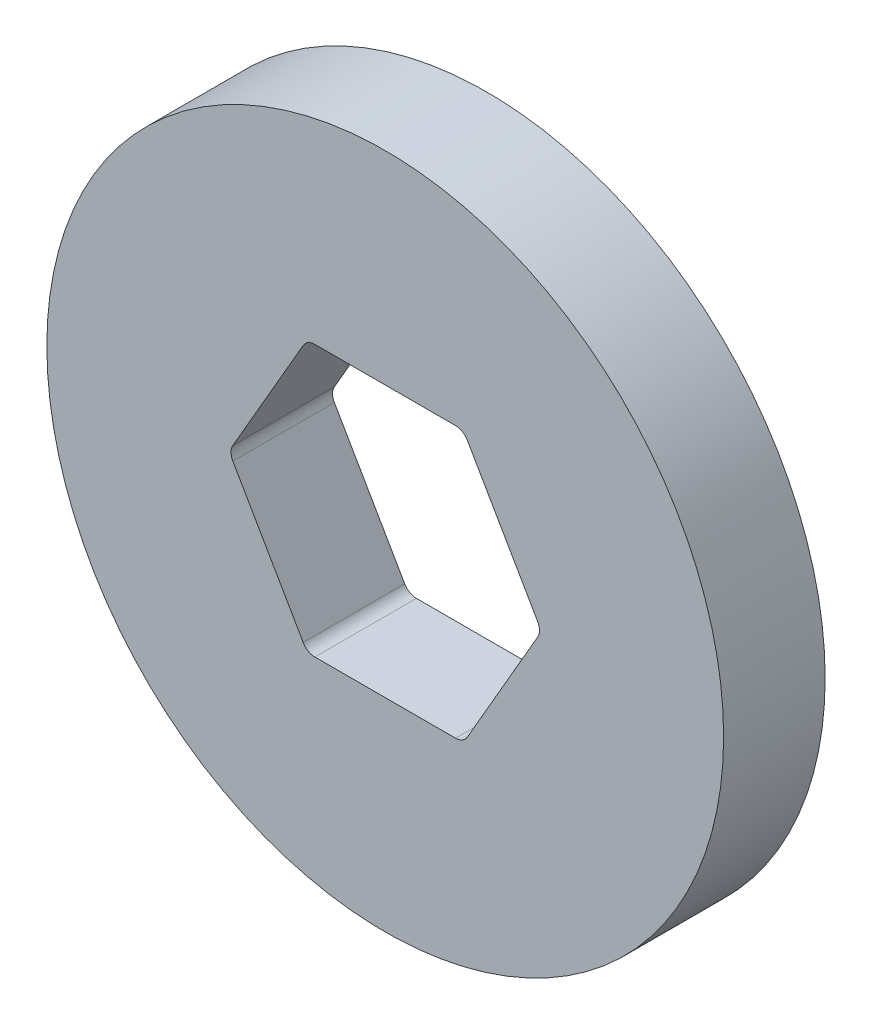
ISO-10303-21;
HEADER;
FILE_DESCRIPTION(('STEP AP214'),'2;1');
FILE_NAME('part.step','',(''),(''),'','','');
FILE_SCHEMA(('AUTOMOTIVE_DESIGN { 1 0 10303 214 1 1 1 1 }'));
ENDSEC;
DATA;
#1=APPLICATION_CONTEXT('core data for automotive mechanical design processes');
#2=APPLICATION_PROTOCOL_DEFINITION('international standard','automotive_design',2000,#1);
#3=PRODUCT_CONTEXT('',#1,'mechanical');
#4=PRODUCT('Part','Part','',(#3));
#5=PRODUCT_RELATED_PRODUCT_CATEGORY('part','',(#4));
#6=PRODUCT_DEFINITION_FORMATION('','',#4);
#7=PRODUCT_DEFINITION_CONTEXT('part definition',#1,'design');
#8=PRODUCT_DEFINITION('design','',#6,#7);
#9=PRODUCT_DEFINITION_SHAPE('','',#8);
#10=(LENGTH_UNIT() NAMED_UNIT(*) SI_UNIT(.MILLI.,.METRE.));
#11=(NAMED_UNIT(*) PLANE_ANGLE_UNIT() SI_UNIT($,.RADIAN.));
#12=(NAMED_UNIT(*) SI_UNIT($,.STERADIAN.) SOLID_ANGLE_UNIT());
#13=UNCERTAINTY_MEASURE_WITH_UNIT(LENGTH_MEASURE(1.E-05),#10,'distance_accuracy_value','');
#14=(GEOMETRIC_REPRESENTATION_CONTEXT(3) GLOBAL_UNCERTAINTY_ASSIGNED_CONTEXT((#13)) GLOBAL_UNIT_ASSIGNED_CONTEXT((#10,
#11,#12)) REPRESENTATION_CONTEXT('',''));
#15=CARTESIAN_POINT('',(0.,0.,0.));
#16=DIRECTION('',(0.,0.,1.));
#17=DIRECTION('',(1.,0.,0.));
#18=AXIS2_PLACEMENT_3D('',#15,#16,#17);
#19=CARTESIAN_POINT('',(0.,0.,7.5));
#20=DIRECTION('',(0.,0.,1.));
#21=DIRECTION('',(1.,0.,0.));
#22=AXIS2_PLACEMENT_3D('',#19,#20,#21);
#23=PLANE('',#22);
#24=CARTESIAN_POINT('',(0.,0.,7.5));
#25=DIRECTION('',(0.,0.,1.));
#26=DIRECTION('',(1.,0.,0.));
#27=AXIS2_PLACEMENT_3D('',#24,#25,#26);
#28=CIRCLE('',#27,50.);
#29=CARTESIAN_POINT('',(50.,0.,7.5));
#30=VERTEX_POINT('',#29);
#31=EDGE_CURVE('E158',#30,#30,#28,.T.);
#32=ORIENTED_EDGE('',*,*,#31,.T.);
#33=EDGE_LOOP('',(#32));
#34=FACE_BOUND('',#33,.T.);
#35=DIRECTION('',(-0.5,0.866025403784439,0.));
#36=VECTOR('',#35,1.);
#37=CARTESIAN_POINT('',(23.094010767585,0.,7.5));
#38=LINE('',#37,#36);
#39=CARTESIAN_POINT('',(22.5166604983954,1.,7.5));
#40=VERTEX_POINT('',#39);
#41=CARTESIAN_POINT('',(12.1243556529821,19.,7.5));
#42=VERTEX_POINT('',#41);
#43=EDGE_CURVE('E274',#40,#42,#38,.T.);
#44=ORIENTED_EDGE('',*,*,#43,.F.);
#45=CARTESIAN_POINT('',(20.7846096908265,0.,7.5));
#46=DIRECTION('',(0.,0.,1.));
#47=DIRECTION('',(1.,0.,0.));
#48=AXIS2_PLACEMENT_3D('',#45,#46,#47);
#49=CIRCLE('',#48,2.);
#50=CARTESIAN_POINT('',(22.5166604983954,-0.999999999999997,7.5));
#51=VERTEX_POINT('',#50);
#52=EDGE_CURVE('E58',#40,#51,#49,.F.);
#53=ORIENTED_EDGE('',*,*,#52,.T.);
#54=DIRECTION('',(0.5,0.866025403784439,0.));
#55=VECTOR('',#54,1.);
#56=CARTESIAN_POINT('',(11.5470053837925,-20.,7.5));
#57=LINE('',#56,#55);
#58=CARTESIAN_POINT('',(12.1243556529821,-19.,7.5));
#59=VERTEX_POINT('',#58);
#60=EDGE_CURVE('E240',#59,#51,#57,.T.);
#61=ORIENTED_EDGE('',*,*,#60,.F.);
#62=CARTESIAN_POINT('',(10.3923048454133,-18.,7.5));
#63=DIRECTION('',(0.,0.,1.));
#64=DIRECTION('',(1.,0.,0.));
#65=AXIS2_PLACEMENT_3D('',#62,#63,#64);
#66=CIRCLE('',#65,2.);
#67=CARTESIAN_POINT('',(10.3923048454133,-20.,7.5));
#68=VERTEX_POINT('',#67);
#69=EDGE_CURVE('E144',#59,#68,#66,.F.);
#70=ORIENTED_EDGE('',*,*,#69,.T.);
#71=DIRECTION('',(1.,0.,0.));
#72=VECTOR('',#71,1.);
#73=CARTESIAN_POINT('',(-11.5470053837925,-20.,7.5));
#74=LINE('',#73,#72);
#75=CARTESIAN_POINT('',(-10.3923048454133,-20.,7.5));
#76=VERTEX_POINT('',#75);
#77=EDGE_CURVE('E247',#76,#68,#74,.T.);
#78=ORIENTED_EDGE('',*,*,#77,.F.);
#79=CARTESIAN_POINT('',(-10.3923048454133,-18.,7.5));
#80=DIRECTION('',(0.,0.,1.));
#81=DIRECTION('',(1.,0.,0.));
#82=AXIS2_PLACEMENT_3D('',#79,#80,#81);
#83=CIRCLE('',#82,2.);
#84=CARTESIAN_POINT('',(-12.1243556529821,-19.,7.5));
#85=VERTEX_POINT('',#84);
#86=EDGE_CURVE('E11',#76,#85,#83,.F.);
#87=ORIENTED_EDGE('',*,*,#86,.T.);
#88=DIRECTION('',(0.5,-0.866025403784439,0.));
#89=VECTOR('',#88,1.);
#90=CARTESIAN_POINT('',(-23.094010767585,0.,7.5));
#91=LINE('',#90,#89);
#92=CARTESIAN_POINT('',(-22.5166604983954,-1.,7.5));
#93=VERTEX_POINT('',#92);
#94=EDGE_CURVE('E245',#93,#85,#91,.T.);
#95=ORIENTED_EDGE('',*,*,#94,.F.);
#96=CARTESIAN_POINT('',(-20.7846096908265,0.,7.5));
#97=DIRECTION('',(0.,0.,1.));
#98=DIRECTION('',(1.,0.,0.));
#99=AXIS2_PLACEMENT_3D('',#96,#97,#98);
#100=CIRCLE('',#99,2.);
#101=CARTESIAN_POINT('',(-22.5166604983954,0.99999999999999,7.5));
#102=VERTEX_POINT('',#101);
#103=EDGE_CURVE('E216',#93,#102,#100,.F.);
#104=ORIENTED_EDGE('',*,*,#103,.T.);
#105=DIRECTION('',(-0.5,-0.866025403784439,0.));
#106=VECTOR('',#105,1.);
#107=CARTESIAN_POINT('',(-11.5470053837925,20.,7.5));
#108=LINE('',#107,#106);
#109=CARTESIAN_POINT('',(-12.1243556529821,19.,7.5));
#110=VERTEX_POINT('',#109);
#111=EDGE_CURVE('E252',#110,#102,#108,.T.);
#112=ORIENTED_EDGE('',*,*,#111,.F.);
#113=CARTESIAN_POINT('',(-10.3923048454133,18.,7.5));
#114=DIRECTION('',(0.,0.,1.));
#115=DIRECTION('',(1.,0.,0.));
#116=AXIS2_PLACEMENT_3D('',#113,#114,#115);
#117=CIRCLE('',#116,2.);
#118=CARTESIAN_POINT('',(-10.3923048454133,20.,7.5));
#119=VERTEX_POINT('',#118);
#120=EDGE_CURVE('E210',#110,#119,#117,.F.);
#121=ORIENTED_EDGE('',*,*,#120,.T.);
#122=DIRECTION('',(-1.,0.,0.));
#123=VECTOR('',#122,1.);
#124=CARTESIAN_POINT('',(11.5470053837925,20.,7.5));
#125=LINE('',#124,#123);
#126=CARTESIAN_POINT('',(10.3923048454133,20.,7.5));
#127=VERTEX_POINT('',#126);
#128=EDGE_CURVE('E258',#127,#119,#125,.T.);
#129=ORIENTED_EDGE('',*,*,#128,.F.);
#130=CARTESIAN_POINT('',(10.3923048454133,18.,7.5));
#131=DIRECTION('',(0.,0.,1.));
#132=DIRECTION('',(1.,0.,0.));
#133=AXIS2_PLACEMENT_3D('',#130,#131,#132);
#134=CIRCLE('',#133,2.);
#135=EDGE_CURVE('E204',#127,#42,#134,.F.);
#136=ORIENTED_EDGE('',*,*,#135,.T.);
#137=EDGE_LOOP('',(#44,#53,#61,#70,#78,#87,#95,#104,#112,#121,#129,#136));
#138=FACE_BOUND('',#137,.T.);
#139=ADVANCED_FACE('F42',(#34,#138),#23,.T.);
#140=CARTESIAN_POINT('',(0.,0.,-7.5));
#141=DIRECTION('',(0.,0.,1.));
#142=DIRECTION('',(1.,0.,0.));
#143=AXIS2_PLACEMENT_3D('',#140,#141,#142);
#144=PLANE('',#143);
#145=CARTESIAN_POINT('',(0.,0.,-7.5));
#146=DIRECTION('',(0.,0.,1.));
#147=DIRECTION('',(1.,0.,0.));
#148=AXIS2_PLACEMENT_3D('',#145,#146,#147);
#149=CIRCLE('',#148,50.);
#150=CARTESIAN_POINT('',(50.,0.,-7.5));
#151=VERTEX_POINT('',#150);
#152=EDGE_CURVE('E165',#151,#151,#149,.T.);
#153=ORIENTED_EDGE('',*,*,#152,.F.);
#154=EDGE_LOOP('',(#153));
#155=FACE_BOUND('',#154,.T.);
#156=DIRECTION('',(1.,0.,0.));
#157=VECTOR('',#156,1.);
#158=CARTESIAN_POINT('',(-11.5470053837925,-20.,-7.5));
#159=LINE('',#158,#157);
#160=CARTESIAN_POINT('',(-10.3923048454133,-20.,-7.5));
#161=VERTEX_POINT('',#160);
#162=CARTESIAN_POINT('',(10.3923048454133,-20.,-7.5));
#163=VERTEX_POINT('',#162);
#164=EDGE_CURVE('E228',#161,#163,#159,.T.);
#165=ORIENTED_EDGE('',*,*,#164,.T.);
#166=CARTESIAN_POINT('',(10.3923048454133,-18.,-7.5));
#167=DIRECTION('',(0.,0.,1.));
#168=DIRECTION('',(1.,0.,0.));
#169=AXIS2_PLACEMENT_3D('',#166,#167,#168);
#170=CIRCLE('',#169,2.);
#171=CARTESIAN_POINT('',(12.1243556529821,-19.,-7.5));
#172=VERTEX_POINT('',#171);
#173=EDGE_CURVE('E219',#163,#172,#170,.T.);
#174=ORIENTED_EDGE('',*,*,#173,.T.);
#175=DIRECTION('',(0.5,0.866025403784439,0.));
#176=VECTOR('',#175,1.);
#177=CARTESIAN_POINT('',(11.5470053837925,-20.,-7.5));
#178=LINE('',#177,#176);
#179=CARTESIAN_POINT('',(22.5166604983954,-0.999999999999997,-7.5));
#180=VERTEX_POINT('',#179);
#181=EDGE_CURVE('E138',#172,#180,#178,.T.);
#182=ORIENTED_EDGE('',*,*,#181,.T.);
#183=CARTESIAN_POINT('',(20.7846096908265,0.,-7.5));
#184=DIRECTION('',(0.,0.,1.));
#185=DIRECTION('',(1.,0.,0.));
#186=AXIS2_PLACEMENT_3D('',#183,#184,#185);
#187=CIRCLE('',#186,2.);
#188=CARTESIAN_POINT('',(22.5166604983954,1.,-7.5));
#189=VERTEX_POINT('',#188);
#190=EDGE_CURVE('E133',#180,#189,#187,.T.);
#191=ORIENTED_EDGE('',*,*,#190,.T.);
#192=DIRECTION('',(-0.5,0.866025403784439,0.));
#193=VECTOR('',#192,1.);
#194=CARTESIAN_POINT('',(23.094010767585,0.,-7.5));
#195=LINE('',#194,#193);
#196=CARTESIAN_POINT('',(12.1243556529821,19.,-7.5));
#197=VERTEX_POINT('',#196);
#198=EDGE_CURVE('E137',#189,#197,#195,.T.);
#199=ORIENTED_EDGE('',*,*,#198,.T.);
#200=CARTESIAN_POINT('',(10.3923048454133,18.,-7.5));
#201=DIRECTION('',(0.,0.,1.));
#202=DIRECTION('',(1.,0.,0.));
#203=AXIS2_PLACEMENT_3D('',#200,#201,#202);
#204=CIRCLE('',#203,2.);
#205=CARTESIAN_POINT('',(10.3923048454133,20.,-7.5));
#206=VERTEX_POINT('',#205);
#207=EDGE_CURVE('E201',#197,#206,#204,.T.);
#208=ORIENTED_EDGE('',*,*,#207,.T.);
#209=DIRECTION('',(-1.,0.,0.));
#210=VECTOR('',#209,1.);
#211=CARTESIAN_POINT('',(11.5470053837925,20.,-7.5));
#212=LINE('',#211,#210);
#213=CARTESIAN_POINT('',(-10.3923048454133,20.,-7.5));
#214=VERTEX_POINT('',#213);
#215=EDGE_CURVE('E154',#206,#214,#212,.T.);
#216=ORIENTED_EDGE('',*,*,#215,.T.);
#217=CARTESIAN_POINT('',(-10.3923048454133,18.,-7.5));
#218=DIRECTION('',(0.,0.,1.));
#219=DIRECTION('',(1.,0.,0.));
#220=AXIS2_PLACEMENT_3D('',#217,#218,#219);
#221=CIRCLE('',#220,2.);
#222=CARTESIAN_POINT('',(-12.1243556529821,19.,-7.5));
#223=VERTEX_POINT('',#222);
#224=EDGE_CURVE('E207',#214,#223,#221,.T.);
#225=ORIENTED_EDGE('',*,*,#224,.T.);
#226=DIRECTION('',(-0.5,-0.866025403784439,0.));
#227=VECTOR('',#226,1.);
#228=CARTESIAN_POINT('',(-11.5470053837925,20.,-7.5));
#229=LINE('',#228,#227);
#230=CARTESIAN_POINT('',(-22.5166604983954,0.99999999999999,-7.5));
#231=VERTEX_POINT('',#230);
#232=EDGE_CURVE('E267',#223,#231,#229,.T.);
#233=ORIENTED_EDGE('',*,*,#232,.T.);
#234=CARTESIAN_POINT('',(-20.7846096908265,0.,-7.5));
#235=DIRECTION('',(0.,0.,1.));
#236=DIRECTION('',(1.,0.,0.));
#237=AXIS2_PLACEMENT_3D('',#234,#235,#236);
#238=CIRCLE('',#237,2.);
#239=CARTESIAN_POINT('',(-22.5166604983954,-1.,-7.5));
#240=VERTEX_POINT('',#239);
#241=EDGE_CURVE('E213',#231,#240,#238,.T.);
#242=ORIENTED_EDGE('',*,*,#241,.T.);
#243=DIRECTION('',(0.5,-0.866025403784439,0.));
#244=VECTOR('',#243,1.);
#245=CARTESIAN_POINT('',(-23.094010767585,0.,-7.5));
#246=LINE('',#245,#244);
#247=CARTESIAN_POINT('',(-12.1243556529821,-19.,-7.5));
#248=VERTEX_POINT('',#247);
#249=EDGE_CURVE('E230',#240,#248,#246,.T.);
#250=ORIENTED_EDGE('',*,*,#249,.T.);
#251=CARTESIAN_POINT('',(-10.3923048454133,-18.,-7.5));
#252=DIRECTION('',(0.,0.,1.));
#253=DIRECTION('',(1.,0.,0.));
#254=AXIS2_PLACEMENT_3D('',#251,#252,#253);
#255=CIRCLE('',#254,2.);
#256=EDGE_CURVE('E51',#248,#161,#255,.T.);
#257=ORIENTED_EDGE('',*,*,#256,.T.);
#258=EDGE_LOOP('',(#165,#174,#182,#191,#199,#208,#216,#225,#233,#242,#250,#257));
#259=FACE_BOUND('',#258,.T.);
#260=ADVANCED_FACE('F136',(#155,#259),#144,.F.);
#261=CARTESIAN_POINT('',(0.,0.,7.5));
#262=DIRECTION('',(0.,0.,-1.));
#263=DIRECTION('',(-1.,0.,0.));
#264=AXIS2_PLACEMENT_3D('',#261,#262,#263);
#265=CYLINDRICAL_SURFACE('',#264,50.);
#266=ORIENTED_EDGE('',*,*,#31,.F.);
#267=EDGE_LOOP('',(#266));
#268=FACE_BOUND('',#267,.T.);
#269=ORIENTED_EDGE('',*,*,#152,.T.);
#270=EDGE_LOOP('',(#269));
#271=FACE_BOUND('',#270,.T.);
#272=ADVANCED_FACE('F314',(#268,#271),#265,.T.);
#273=CARTESIAN_POINT('',(11.5470053837925,-20.,7.5));
#274=DIRECTION('',(-0.866025403784439,0.5,0.));
#275=DIRECTION('',(-0.5,-0.866025403784439,0.));
#276=AXIS2_PLACEMENT_3D('',#273,#274,#275);
#277=PLANE('',#276);
#278=ORIENTED_EDGE('',*,*,#181,.F.);
#279=DIRECTION('',(0.,0.,-1.));
#280=VECTOR('',#279,1.);
#281=CARTESIAN_POINT('',(12.1243556529821,-19.,7.5));
#282=LINE('',#281,#280);
#283=EDGE_CURVE('E65',#172,#59,#282,.F.);
#284=ORIENTED_EDGE('',*,*,#283,.T.);
#285=ORIENTED_EDGE('',*,*,#60,.T.);
#286=DIRECTION('',(0.,0.,-1.));
#287=VECTOR('',#286,1.);
#288=CARTESIAN_POINT('',(22.5166604983954,-0.999999999999999,-7.5));
#289=LINE('',#288,#287);
#290=EDGE_CURVE('E196',#51,#180,#289,.T.);
#291=ORIENTED_EDGE('',*,*,#290,.T.);
#292=EDGE_LOOP('',(#278,#284,#285,#291));
#293=FACE_BOUND('',#292,.T.);
#294=ADVANCED_FACE('F318',(#293),#277,.T.);
#295=CARTESIAN_POINT('',(23.094010767585,0.,7.5));
#296=DIRECTION('',(-0.866025403784439,-0.5,0.));
#297=DIRECTION('',(0.5,-0.866025403784439,0.));
#298=AXIS2_PLACEMENT_3D('',#295,#296,#297);
#299=PLANE('',#298);
#300=ORIENTED_EDGE('',*,*,#43,.T.);
#301=DIRECTION('',(0.,0.,-1.));
#302=VECTOR('',#301,1.);
#303=CARTESIAN_POINT('',(12.1243556529821,19.,-7.5));
#304=LINE('',#303,#302);
#305=EDGE_CURVE('E152',#42,#197,#304,.T.);
#306=ORIENTED_EDGE('',*,*,#305,.T.);
#307=ORIENTED_EDGE('',*,*,#198,.F.);
#308=DIRECTION('',(0.,0.,-1.));
#309=VECTOR('',#308,1.);
#310=CARTESIAN_POINT('',(22.5166604983954,1.,7.5));
#311=LINE('',#310,#309);
#312=EDGE_CURVE('E150',#189,#40,#311,.F.);
#313=ORIENTED_EDGE('',*,*,#312,.T.);
#314=EDGE_LOOP('',(#300,#306,#307,#313));
#315=FACE_BOUND('',#314,.T.);
#316=ADVANCED_FACE('F149',(#315),#299,.T.);
#317=CARTESIAN_POINT('',(11.5470053837925,20.,7.5));
#318=DIRECTION('',(0.,-1.,0.));
#319=DIRECTION('',(0.,0.,-1.));
#320=AXIS2_PLACEMENT_3D('',#317,#318,#319);
#321=PLANE('',#320);
#322=ORIENTED_EDGE('',*,*,#215,.F.);
#323=DIRECTION('',(0.,0.,-1.));
#324=VECTOR('',#323,1.);
#325=CARTESIAN_POINT('',(10.3923048454133,20.,7.5));
#326=LINE('',#325,#324);
#327=EDGE_CURVE('E172',#206,#127,#326,.F.);
#328=ORIENTED_EDGE('',*,*,#327,.T.);
#329=ORIENTED_EDGE('',*,*,#128,.T.);
#330=DIRECTION('',(0.,0.,-1.));
#331=VECTOR('',#330,1.);
#332=CARTESIAN_POINT('',(-10.3923048454133,20.,-7.5));
#333=LINE('',#332,#331);
#334=EDGE_CURVE('E162',#119,#214,#333,.T.);
#335=ORIENTED_EDGE('',*,*,#334,.T.);
#336=EDGE_LOOP('',(#322,#328,#329,#335));
#337=FACE_BOUND('',#336,.T.);
#338=ADVANCED_FACE('F283',(#337),#321,.T.);
#339=CARTESIAN_POINT('',(-11.5470053837925,20.,7.5));
#340=DIRECTION('',(0.866025403784439,-0.5,0.));
#341=DIRECTION('',(0.5,0.866025403784439,0.));
#342=AXIS2_PLACEMENT_3D('',#339,#340,#341);
#343=PLANE('',#342);
#344=ORIENTED_EDGE('',*,*,#232,.F.);
#345=DIRECTION('',(0.,0.,-1.));
#346=VECTOR('',#345,1.);
#347=CARTESIAN_POINT('',(-12.1243556529821,19.,7.5));
#348=LINE('',#347,#346);
#349=EDGE_CURVE('E179',#223,#110,#348,.F.);
#350=ORIENTED_EDGE('',*,*,#349,.T.);
#351=ORIENTED_EDGE('',*,*,#111,.T.);
#352=DIRECTION('',(0.,0.,-1.));
#353=VECTOR('',#352,1.);
#354=CARTESIAN_POINT('',(-22.5166604983954,0.999999999999997,-7.5));
#355=LINE('',#354,#353);
#356=EDGE_CURVE('E175',#102,#231,#355,.T.);
#357=ORIENTED_EDGE('',*,*,#356,.T.);
#358=EDGE_LOOP('',(#344,#350,#351,#357));
#359=FACE_BOUND('',#358,.T.);
#360=ADVANCED_FACE('F292',(#359),#343,.T.);
#361=CARTESIAN_POINT('',(-23.094010767585,0.,7.5));
#362=DIRECTION('',(0.866025403784439,0.5,0.));
#363=DIRECTION('',(-0.5,0.866025403784439,0.));
#364=AXIS2_PLACEMENT_3D('',#361,#362,#363);
#365=PLANE('',#364);
#366=ORIENTED_EDGE('',*,*,#249,.F.);
#367=DIRECTION('',(0.,0.,-1.));
#368=VECTOR('',#367,1.);
#369=CARTESIAN_POINT('',(-22.5166604983954,-1.,7.5));
#370=LINE('',#369,#368);
#371=EDGE_CURVE('E186',#240,#93,#370,.F.);
#372=ORIENTED_EDGE('',*,*,#371,.T.);
#373=ORIENTED_EDGE('',*,*,#94,.T.);
#374=DIRECTION('',(0.,0.,-1.));
#375=VECTOR('',#374,1.);
#376=CARTESIAN_POINT('',(-12.1243556529821,-19.,-7.5));
#377=LINE('',#376,#375);
#378=EDGE_CURVE('E182',#85,#248,#377,.T.);
#379=ORIENTED_EDGE('',*,*,#378,.T.);
#380=EDGE_LOOP('',(#366,#372,#373,#379));
#381=FACE_BOUND('',#380,.T.);
#382=ADVANCED_FACE('F249',(#381),#365,.T.);
#383=CARTESIAN_POINT('',(-11.5470053837925,-20.,7.5));
#384=DIRECTION('',(0.,1.,0.));
#385=DIRECTION('',(-1.,0.,0.));
#386=AXIS2_PLACEMENT_3D('',#383,#384,#385);
#387=PLANE('',#386);
#388=ORIENTED_EDGE('',*,*,#77,.T.);
#389=DIRECTION('',(0.,0.,-1.));
#390=VECTOR('',#389,1.);
#391=CARTESIAN_POINT('',(10.3923048454133,-20.,-7.5));
#392=LINE('',#391,#390);
#393=EDGE_CURVE('E192',#68,#163,#392,.T.);
#394=ORIENTED_EDGE('',*,*,#393,.T.);
#395=ORIENTED_EDGE('',*,*,#164,.F.);
#396=DIRECTION('',(0.,0.,-1.));
#397=VECTOR('',#396,1.);
#398=CARTESIAN_POINT('',(-10.3923048454133,-20.,7.5));
#399=LINE('',#398,#397);
#400=EDGE_CURVE('E189',#161,#76,#399,.F.);
#401=ORIENTED_EDGE('',*,*,#400,.T.);
#402=EDGE_LOOP('',(#388,#394,#395,#401));
#403=FACE_BOUND('',#402,.T.);
#404=ADVANCED_FACE('F236',(#403),#387,.T.);
#405=CARTESIAN_POINT('',(10.3923048454133,18.,7.5));
#406=DIRECTION('',(0.,0.,1.));
#407=DIRECTION('',(1.,0.,0.));
#408=AXIS2_PLACEMENT_3D('',#405,#406,#407);
#409=CYLINDRICAL_SURFACE('',#408,2.);
#410=ORIENTED_EDGE('',*,*,#135,.F.);
#411=ORIENTED_EDGE('',*,*,#327,.F.);
#412=ORIENTED_EDGE('',*,*,#207,.F.);
#413=ORIENTED_EDGE('',*,*,#305,.F.);
#414=EDGE_LOOP('',(#410,#411,#412,#413));
#415=FACE_BOUND('',#414,.T.);
#416=ADVANCED_FACE('F306',(#415),#409,.F.);
#417=CARTESIAN_POINT('',(-10.3923048454133,18.,7.5));
#418=DIRECTION('',(0.,0.,1.));
#419=DIRECTION('',(1.,0.,0.));
#420=AXIS2_PLACEMENT_3D('',#417,#418,#419);
#421=CYLINDRICAL_SURFACE('',#420,2.);
#422=ORIENTED_EDGE('',*,*,#120,.F.);
#423=ORIENTED_EDGE('',*,*,#349,.F.);
#424=ORIENTED_EDGE('',*,*,#224,.F.);
#425=ORIENTED_EDGE('',*,*,#334,.F.);
#426=EDGE_LOOP('',(#422,#423,#424,#425));
#427=FACE_BOUND('',#426,.T.);
#428=ADVANCED_FACE('F288',(#427),#421,.F.);
#429=CARTESIAN_POINT('',(-20.7846096908265,0.,7.5));
#430=DIRECTION('',(0.,0.,1.));
#431=DIRECTION('',(1.,0.,0.));
#432=AXIS2_PLACEMENT_3D('',#429,#430,#431);
#433=CYLINDRICAL_SURFACE('',#432,2.);
#434=ORIENTED_EDGE('',*,*,#103,.F.);
#435=ORIENTED_EDGE('',*,*,#371,.F.);
#436=ORIENTED_EDGE('',*,*,#241,.F.);
#437=ORIENTED_EDGE('',*,*,#356,.F.);
#438=EDGE_LOOP('',(#434,#435,#436,#437));
#439=FACE_BOUND('',#438,.T.);
#440=ADVANCED_FACE('F296',(#439),#433,.F.);
#441=CARTESIAN_POINT('',(10.3923048454133,-18.,7.5));
#442=DIRECTION('',(0.,0.,1.));
#443=DIRECTION('',(1.,0.,0.));
#444=AXIS2_PLACEMENT_3D('',#441,#442,#443);
#445=CYLINDRICAL_SURFACE('',#444,2.);
#446=ORIENTED_EDGE('',*,*,#69,.F.);
#447=ORIENTED_EDGE('',*,*,#283,.F.);
#448=ORIENTED_EDGE('',*,*,#173,.F.);
#449=ORIENTED_EDGE('',*,*,#393,.F.);
#450=EDGE_LOOP('',(#446,#447,#448,#449));
#451=FACE_BOUND('',#450,.T.);
#452=ADVANCED_FACE('F298',(#451),#445,.F.);
#453=CARTESIAN_POINT('',(20.7846096908265,0.,7.5));
#454=DIRECTION('',(0.,0.,1.));
#455=DIRECTION('',(1.,0.,0.));
#456=AXIS2_PLACEMENT_3D('',#453,#454,#455);
#457=CYLINDRICAL_SURFACE('',#456,2.);
#458=ORIENTED_EDGE('',*,*,#52,.F.);
#459=ORIENTED_EDGE('',*,*,#312,.F.);
#460=ORIENTED_EDGE('',*,*,#190,.F.);
#461=ORIENTED_EDGE('',*,*,#290,.F.);
#462=EDGE_LOOP('',(#458,#459,#460,#461));
#463=FACE_BOUND('',#462,.T.);
#464=ADVANCED_FACE('F156',(#463),#457,.F.);
#465=CARTESIAN_POINT('',(-10.3923048454133,-18.,7.5));
#466=DIRECTION('',(0.,0.,1.));
#467=DIRECTION('',(1.,0.,0.));
#468=AXIS2_PLACEMENT_3D('',#465,#466,#467);
#469=CYLINDRICAL_SURFACE('',#468,2.);
#470=ORIENTED_EDGE('',*,*,#86,.F.);
#471=ORIENTED_EDGE('',*,*,#400,.F.);
#472=ORIENTED_EDGE('',*,*,#256,.F.);
#473=ORIENTED_EDGE('',*,*,#378,.F.);
#474=EDGE_LOOP('',(#470,#471,#472,#473));
#475=FACE_BOUND('',#474,.T.);
#476=ADVANCED_FACE('F44',(#475),#469,.F.);
#477=CLOSED_SHELL('',(#139,#260,#272,#294,#316,#338,#360,#382,#404,#416,#428,#440,#452,#464,#476));
#478=MANIFOLD_SOLID_BREP('B2',#477);
#479=ADVANCED_BREP_SHAPE_REPRESENTATION('',(#18,#478),#14);
#480=SHAPE_DEFINITION_REPRESENTATION(#9,#479);
ENDSEC;
END-ISO-10303-21;
